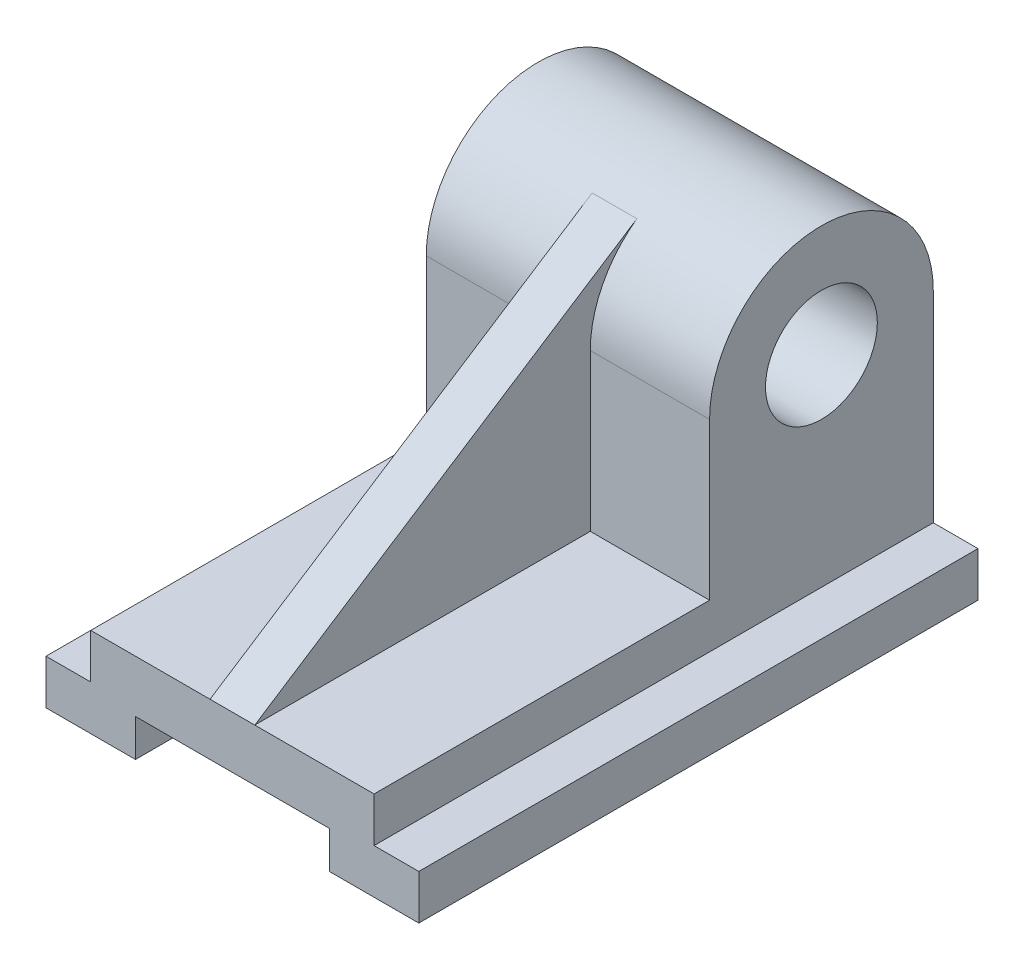
ISO-10303-21;
HEADER;
FILE_DESCRIPTION(('STEP AP214'),'2;1');
FILE_NAME('part.step','',(''),(''),'','','');
FILE_SCHEMA(('AUTOMOTIVE_DESIGN { 1 0 10303 214 1 1 1 1 }'));
ENDSEC;
DATA;
#1=APPLICATION_CONTEXT('core data for automotive mechanical design processes');
#2=APPLICATION_PROTOCOL_DEFINITION('international standard','automotive_design',2000,#1);
#3=PRODUCT_CONTEXT('',#1,'mechanical');
#4=PRODUCT('Part','Part','',(#3));
#5=PRODUCT_RELATED_PRODUCT_CATEGORY('part','',(#4));
#6=PRODUCT_DEFINITION_FORMATION('','',#4);
#7=PRODUCT_DEFINITION_CONTEXT('part definition',#1,'design');
#8=PRODUCT_DEFINITION('design','',#6,#7);
#9=PRODUCT_DEFINITION_SHAPE('','',#8);
#10=(LENGTH_UNIT() NAMED_UNIT(*) SI_UNIT(.MILLI.,.METRE.));
#11=(NAMED_UNIT(*) PLANE_ANGLE_UNIT() SI_UNIT($,.RADIAN.));
#12=(NAMED_UNIT(*) SI_UNIT($,.STERADIAN.) SOLID_ANGLE_UNIT());
#13=UNCERTAINTY_MEASURE_WITH_UNIT(LENGTH_MEASURE(1.E-05),#10,'distance_accuracy_value','');
#14=(GEOMETRIC_REPRESENTATION_CONTEXT(3) GLOBAL_UNCERTAINTY_ASSIGNED_CONTEXT((#13)) GLOBAL_UNIT_ASSIGNED_CONTEXT((#10,
#11,#12)) REPRESENTATION_CONTEXT('',''));
#15=CARTESIAN_POINT('',(0.,0.,0.));
#16=DIRECTION('',(0.,0.,1.));
#17=DIRECTION('',(1.,0.,0.));
#18=AXIS2_PLACEMENT_3D('',#15,#16,#17);
#19=CARTESIAN_POINT('',(-38.,12.,150.));
#20=DIRECTION('',(0.,-1.,0.));
#21=DIRECTION('',(0.,0.,-1.));
#22=AXIS2_PLACEMENT_3D('',#19,#20,#21);
#23=PLANE('',#22);
#24=DIRECTION('',(0.,0.,1.));
#25=VECTOR('',#24,1.);
#26=CARTESIAN_POINT('',(-6.,12.,150.));
#27=LINE('',#26,#25);
#28=CARTESIAN_POINT('',(-6.,12.,60.));
#29=VERTEX_POINT('',#28);
#30=CARTESIAN_POINT('',(-6.,12.,150.));
#31=VERTEX_POINT('',#30);
#32=EDGE_CURVE('E163',#29,#31,#27,.T.);
#33=ORIENTED_EDGE('',*,*,#32,.F.);
#34=DIRECTION('',(1.,0.,0.));
#35=VECTOR('',#34,1.);
#36=CARTESIAN_POINT('',(-38.,12.,60.));
#37=LINE('',#36,#35);
#38=CARTESIAN_POINT('',(-38.,12.,60.));
#39=VERTEX_POINT('',#38);
#40=EDGE_CURVE('E62',#39,#29,#37,.T.);
#41=ORIENTED_EDGE('',*,*,#40,.F.);
#42=DIRECTION('',(0.,0.,-1.));
#43=VECTOR('',#42,1.);
#44=CARTESIAN_POINT('',(-38.,12.,150.));
#45=LINE('',#44,#43);
#46=CARTESIAN_POINT('',(-38.,12.,150.));
#47=VERTEX_POINT('',#46);
#48=EDGE_CURVE('E183',#47,#39,#45,.T.);
#49=ORIENTED_EDGE('',*,*,#48,.F.);
#50=DIRECTION('',(-1.,0.,0.));
#51=VECTOR('',#50,1.);
#52=CARTESIAN_POINT('',(-38.,12.,150.));
#53=LINE('',#52,#51);
#54=EDGE_CURVE('E182',#31,#47,#53,.T.);
#55=ORIENTED_EDGE('',*,*,#54,.F.);
#56=EDGE_LOOP('',(#33,#41,#49,#55));
#57=FACE_BOUND('',#56,.T.);
#58=ADVANCED_FACE('F39',(#57),#23,.F.);
#59=CARTESIAN_POINT('',(-38.,54.,60.));
#60=DIRECTION('',(0.,0.,1.));
#61=DIRECTION('',(1.,0.,0.));
#62=AXIS2_PLACEMENT_3D('',#59,#60,#61);
#63=PLANE('',#62);
#64=ORIENTED_EDGE('',*,*,#40,.T.);
#65=DIRECTION('',(0.,1.,0.));
#66=VECTOR('',#65,1.);
#67=CARTESIAN_POINT('',(-6.,54.,60.));
#68=LINE('',#67,#66);
#69=CARTESIAN_POINT('',(-6.,54.,60.));
#70=VERTEX_POINT('',#69);
#71=EDGE_CURVE('E166',#29,#70,#68,.T.);
#72=ORIENTED_EDGE('',*,*,#71,.T.);
#73=DIRECTION('',(1.,0.,0.));
#74=VECTOR('',#73,1.);
#75=CARTESIAN_POINT('',(-38.,54.,60.));
#76=LINE('',#75,#74);
#77=CARTESIAN_POINT('',(-38.,54.,60.));
#78=VERTEX_POINT('',#77);
#79=EDGE_CURVE('E231',#78,#70,#76,.T.);
#80=ORIENTED_EDGE('',*,*,#79,.F.);
#81=DIRECTION('',(0.,-1.,0.));
#82=VECTOR('',#81,1.);
#83=CARTESIAN_POINT('',(-38.,54.,60.));
#84=LINE('',#83,#82);
#85=EDGE_CURVE('E215',#78,#39,#84,.T.);
#86=ORIENTED_EDGE('',*,*,#85,.T.);
#87=EDGE_LOOP('',(#64,#72,#80,#86));
#88=FACE_BOUND('',#87,.T.);
#89=ADVANCED_FACE('F428',(#88),#63,.T.);
#90=CARTESIAN_POINT('',(6.,12.,60.));
#91=VERTEX_POINT('',#90);
#92=CARTESIAN_POINT('',(38.,12.,60.));
#93=VERTEX_POINT('',#92);
#94=EDGE_CURVE('E230',#91,#93,#37,.T.);
#95=ORIENTED_EDGE('',*,*,#94,.F.);
#96=DIRECTION('',(0.,0.,1.));
#97=VECTOR('',#96,1.);
#98=CARTESIAN_POINT('',(6.,12.,150.));
#99=LINE('',#98,#97);
#100=CARTESIAN_POINT('',(6.,12.,150.));
#101=VERTEX_POINT('',#100);
#102=EDGE_CURVE('E195',#91,#101,#99,.T.);
#103=ORIENTED_EDGE('',*,*,#102,.T.);
#104=CARTESIAN_POINT('',(38.,12.,150.));
#105=VERTEX_POINT('',#104);
#106=EDGE_CURVE('E187',#105,#101,#53,.T.);
#107=ORIENTED_EDGE('',*,*,#106,.F.);
#108=DIRECTION('',(0.,0.,-1.));
#109=VECTOR('',#108,1.);
#110=CARTESIAN_POINT('',(38.,12.,150.));
#111=LINE('',#110,#109);
#112=EDGE_CURVE('E316',#105,#93,#111,.T.);
#113=ORIENTED_EDGE('',*,*,#112,.T.);
#114=EDGE_LOOP('',(#95,#103,#107,#113));
#115=FACE_BOUND('',#114,.T.);
#116=ADVANCED_FACE('F400',(#115),#23,.F.);
#117=CARTESIAN_POINT('',(-50.,-12.,150.));
#118=DIRECTION('',(1.,0.,0.));
#119=DIRECTION('',(0.,0.,-1.));
#120=AXIS2_PLACEMENT_3D('',#117,#118,#119);
#121=PLANE('',#120);
#122=DIRECTION('',(0.,-1.,0.));
#123=VECTOR('',#122,1.);
#124=CARTESIAN_POINT('',(-50.,-12.,0.));
#125=LINE('',#124,#123);
#126=CARTESIAN_POINT('',(-50.,0.,0.));
#127=VERTEX_POINT('',#126);
#128=CARTESIAN_POINT('',(-50.,-12.,0.));
#129=VERTEX_POINT('',#128);
#130=EDGE_CURVE('E229',#127,#129,#125,.T.);
#131=ORIENTED_EDGE('',*,*,#130,.T.);
#132=DIRECTION('',(0.,0.,-1.));
#133=VECTOR('',#132,1.);
#134=CARTESIAN_POINT('',(-50.,-12.,150.));
#135=LINE('',#134,#133);
#136=CARTESIAN_POINT('',(-50.,-12.,150.));
#137=VERTEX_POINT('',#136);
#138=EDGE_CURVE('E48',#137,#129,#135,.T.);
#139=ORIENTED_EDGE('',*,*,#138,.F.);
#140=DIRECTION('',(0.,-1.,0.));
#141=VECTOR('',#140,1.);
#142=CARTESIAN_POINT('',(-50.,-12.,150.));
#143=LINE('',#142,#141);
#144=CARTESIAN_POINT('',(-50.,0.,150.));
#145=VERTEX_POINT('',#144);
#146=EDGE_CURVE('E238',#145,#137,#143,.T.);
#147=ORIENTED_EDGE('',*,*,#146,.F.);
#148=DIRECTION('',(0.,0.,-1.));
#149=VECTOR('',#148,1.);
#150=CARTESIAN_POINT('',(-50.,0.,150.));
#151=LINE('',#150,#149);
#152=EDGE_CURVE('E273',#145,#127,#151,.T.);
#153=ORIENTED_EDGE('',*,*,#152,.T.);
#154=EDGE_LOOP('',(#131,#139,#147,#153));
#155=FACE_BOUND('',#154,.T.);
#156=ADVANCED_FACE('F41',(#155),#121,.F.);
#157=CARTESIAN_POINT('',(-50.,-12.,150.));
#158=DIRECTION('',(0.,1.,0.));
#159=DIRECTION('',(0.,0.,1.));
#160=AXIS2_PLACEMENT_3D('',#157,#158,#159);
#161=PLANE('',#160);
#162=DIRECTION('',(1.,0.,0.));
#163=VECTOR('',#162,1.);
#164=CARTESIAN_POINT('',(-50.,-12.,0.));
#165=LINE('',#164,#163);
#166=CARTESIAN_POINT('',(-26.,-12.,0.));
#167=VERTEX_POINT('',#166);
#168=EDGE_CURVE('E277',#129,#167,#165,.T.);
#169=ORIENTED_EDGE('',*,*,#168,.T.);
#170=DIRECTION('',(0.,0.,-1.));
#171=VECTOR('',#170,1.);
#172=CARTESIAN_POINT('',(-26.,-12.,150.));
#173=LINE('',#172,#171);
#174=CARTESIAN_POINT('',(-26.,-12.,150.));
#175=VERTEX_POINT('',#174);
#176=EDGE_CURVE('E344',#175,#167,#173,.T.);
#177=ORIENTED_EDGE('',*,*,#176,.F.);
#178=DIRECTION('',(1.,0.,0.));
#179=VECTOR('',#178,1.);
#180=CARTESIAN_POINT('',(-50.,-12.,150.));
#181=LINE('',#180,#179);
#182=EDGE_CURVE('E242',#137,#175,#181,.T.);
#183=ORIENTED_EDGE('',*,*,#182,.F.);
#184=ORIENTED_EDGE('',*,*,#138,.T.);
#185=EDGE_LOOP('',(#169,#177,#183,#184));
#186=FACE_BOUND('',#185,.T.);
#187=ADVANCED_FACE('F351',(#186),#161,.F.);
#188=CARTESIAN_POINT('',(-26.,-12.,150.));
#189=DIRECTION('',(-1.,0.,0.));
#190=DIRECTION('',(0.,-1.,0.));
#191=AXIS2_PLACEMENT_3D('',#188,#189,#190);
#192=PLANE('',#191);
#193=DIRECTION('',(0.,1.,0.));
#194=VECTOR('',#193,1.);
#195=CARTESIAN_POINT('',(-26.,-12.,0.));
#196=LINE('',#195,#194);
#197=CARTESIAN_POINT('',(-26.,-2.,0.));
#198=VERTEX_POINT('',#197);
#199=EDGE_CURVE('E280',#167,#198,#196,.T.);
#200=ORIENTED_EDGE('',*,*,#199,.T.);
#201=DIRECTION('',(0.,0.,-1.));
#202=VECTOR('',#201,1.);
#203=CARTESIAN_POINT('',(-26.,-2.,150.));
#204=LINE('',#203,#202);
#205=CARTESIAN_POINT('',(-26.,-2.,150.));
#206=VERTEX_POINT('',#205);
#207=EDGE_CURVE('E340',#206,#198,#204,.T.);
#208=ORIENTED_EDGE('',*,*,#207,.F.);
#209=DIRECTION('',(0.,1.,0.));
#210=VECTOR('',#209,1.);
#211=CARTESIAN_POINT('',(-26.,-12.,150.));
#212=LINE('',#211,#210);
#213=EDGE_CURVE('E246',#175,#206,#212,.T.);
#214=ORIENTED_EDGE('',*,*,#213,.F.);
#215=ORIENTED_EDGE('',*,*,#176,.T.);
#216=EDGE_LOOP('',(#200,#208,#214,#215));
#217=FACE_BOUND('',#216,.T.);
#218=ADVANCED_FACE('F365',(#217),#192,.F.);
#219=CARTESIAN_POINT('',(-26.,-2.,150.));
#220=DIRECTION('',(0.,1.,0.));
#221=DIRECTION('',(0.,0.,1.));
#222=AXIS2_PLACEMENT_3D('',#219,#220,#221);
#223=PLANE('',#222);
#224=DIRECTION('',(0.,0.,-1.));
#225=VECTOR('',#224,1.);
#226=CARTESIAN_POINT('',(26.,-2.,150.));
#227=LINE('',#226,#225);
#228=CARTESIAN_POINT('',(26.,-2.,150.));
#229=VERTEX_POINT('',#228);
#230=CARTESIAN_POINT('',(26.,-2.,0.));
#231=VERTEX_POINT('',#230);
#232=EDGE_CURVE('E336',#229,#231,#227,.T.);
#233=ORIENTED_EDGE('',*,*,#232,.F.);
#234=DIRECTION('',(1.,0.,0.));
#235=VECTOR('',#234,1.);
#236=CARTESIAN_POINT('',(-26.,-2.,150.));
#237=LINE('',#236,#235);
#238=EDGE_CURVE('E249',#206,#229,#237,.T.);
#239=ORIENTED_EDGE('',*,*,#238,.F.);
#240=ORIENTED_EDGE('',*,*,#207,.T.);
#241=DIRECTION('',(1.,0.,0.));
#242=VECTOR('',#241,1.);
#243=CARTESIAN_POINT('',(-26.,-2.,0.));
#244=LINE('',#243,#242);
#245=EDGE_CURVE('E283',#198,#231,#244,.T.);
#246=ORIENTED_EDGE('',*,*,#245,.T.);
#247=EDGE_LOOP('',(#233,#239,#240,#246));
#248=FACE_BOUND('',#247,.T.);
#249=ADVANCED_FACE('F370',(#248),#223,.F.);
#250=CARTESIAN_POINT('',(26.,-2.,150.));
#251=DIRECTION('',(1.,0.,0.));
#252=DIRECTION('',(0.,0.,-1.));
#253=AXIS2_PLACEMENT_3D('',#250,#251,#252);
#254=PLANE('',#253);
#255=DIRECTION('',(0.,-1.,0.));
#256=VECTOR('',#255,1.);
#257=CARTESIAN_POINT('',(26.,-2.,0.));
#258=LINE('',#257,#256);
#259=CARTESIAN_POINT('',(26.,-12.,0.));
#260=VERTEX_POINT('',#259);
#261=EDGE_CURVE('E286',#231,#260,#258,.T.);
#262=ORIENTED_EDGE('',*,*,#261,.T.);
#263=DIRECTION('',(0.,0.,-1.));
#264=VECTOR('',#263,1.);
#265=CARTESIAN_POINT('',(26.,-12.,150.));
#266=LINE('',#265,#264);
#267=CARTESIAN_POINT('',(26.,-12.,150.));
#268=VERTEX_POINT('',#267);
#269=EDGE_CURVE('E332',#268,#260,#266,.T.);
#270=ORIENTED_EDGE('',*,*,#269,.F.);
#271=DIRECTION('',(0.,-1.,0.));
#272=VECTOR('',#271,1.);
#273=CARTESIAN_POINT('',(26.,-2.,150.));
#274=LINE('',#273,#272);
#275=EDGE_CURVE('E252',#229,#268,#274,.T.);
#276=ORIENTED_EDGE('',*,*,#275,.F.);
#277=ORIENTED_EDGE('',*,*,#232,.T.);
#278=EDGE_LOOP('',(#262,#270,#276,#277));
#279=FACE_BOUND('',#278,.T.);
#280=ADVANCED_FACE('F418',(#279),#254,.F.);
#281=CARTESIAN_POINT('',(26.,-12.,150.));
#282=DIRECTION('',(0.,1.,0.));
#283=DIRECTION('',(0.,0.,1.));
#284=AXIS2_PLACEMENT_3D('',#281,#282,#283);
#285=PLANE('',#284);
#286=DIRECTION('',(1.,0.,0.));
#287=VECTOR('',#286,1.);
#288=CARTESIAN_POINT('',(26.,-12.,0.));
#289=LINE('',#288,#287);
#290=CARTESIAN_POINT('',(50.,-12.,0.));
#291=VERTEX_POINT('',#290);
#292=EDGE_CURVE('E289',#260,#291,#289,.T.);
#293=ORIENTED_EDGE('',*,*,#292,.T.);
#294=DIRECTION('',(0.,0.,-1.));
#295=VECTOR('',#294,1.);
#296=CARTESIAN_POINT('',(50.,-12.,150.));
#297=LINE('',#296,#295);
#298=CARTESIAN_POINT('',(50.,-12.,150.));
#299=VERTEX_POINT('',#298);
#300=EDGE_CURVE('E328',#299,#291,#297,.T.);
#301=ORIENTED_EDGE('',*,*,#300,.F.);
#302=DIRECTION('',(1.,0.,0.));
#303=VECTOR('',#302,1.);
#304=CARTESIAN_POINT('',(26.,-12.,150.));
#305=LINE('',#304,#303);
#306=EDGE_CURVE('E255',#268,#299,#305,.T.);
#307=ORIENTED_EDGE('',*,*,#306,.F.);
#308=ORIENTED_EDGE('',*,*,#269,.T.);
#309=EDGE_LOOP('',(#293,#301,#307,#308));
#310=FACE_BOUND('',#309,.T.);
#311=ADVANCED_FACE('F416',(#310),#285,.F.);
#312=CARTESIAN_POINT('',(50.,-12.,150.));
#313=DIRECTION('',(-1.,0.,0.));
#314=DIRECTION('',(0.,0.,1.));
#315=AXIS2_PLACEMENT_3D('',#312,#313,#314);
#316=PLANE('',#315);
#317=DIRECTION('',(0.,1.,0.));
#318=VECTOR('',#317,1.);
#319=CARTESIAN_POINT('',(50.,-12.,0.));
#320=LINE('',#319,#318);
#321=CARTESIAN_POINT('',(50.,0.,0.));
#322=VERTEX_POINT('',#321);
#323=EDGE_CURVE('E292',#291,#322,#320,.T.);
#324=ORIENTED_EDGE('',*,*,#323,.T.);
#325=DIRECTION('',(0.,0.,-1.));
#326=VECTOR('',#325,1.);
#327=CARTESIAN_POINT('',(50.,0.,150.));
#328=LINE('',#327,#326);
#329=CARTESIAN_POINT('',(50.,0.,150.));
#330=VERTEX_POINT('',#329);
#331=EDGE_CURVE('E324',#330,#322,#328,.T.);
#332=ORIENTED_EDGE('',*,*,#331,.F.);
#333=DIRECTION('',(0.,1.,0.));
#334=VECTOR('',#333,1.);
#335=CARTESIAN_POINT('',(50.,-12.,150.));
#336=LINE('',#335,#334);
#337=EDGE_CURVE('E258',#299,#330,#336,.T.);
#338=ORIENTED_EDGE('',*,*,#337,.F.);
#339=ORIENTED_EDGE('',*,*,#300,.T.);
#340=EDGE_LOOP('',(#324,#332,#338,#339));
#341=FACE_BOUND('',#340,.T.);
#342=ADVANCED_FACE('F412',(#341),#316,.F.);
#343=CARTESIAN_POINT('',(38.,0.,150.));
#344=DIRECTION('',(0.,-1.,0.));
#345=DIRECTION('',(0.,0.,-1.));
#346=AXIS2_PLACEMENT_3D('',#343,#344,#345);
#347=PLANE('',#346);
#348=DIRECTION('',(-1.,0.,0.));
#349=VECTOR('',#348,1.);
#350=CARTESIAN_POINT('',(38.,0.,0.));
#351=LINE('',#350,#349);
#352=CARTESIAN_POINT('',(38.,0.,0.));
#353=VERTEX_POINT('',#352);
#354=EDGE_CURVE('E295',#322,#353,#351,.T.);
#355=ORIENTED_EDGE('',*,*,#354,.T.);
#356=DIRECTION('',(0.,0.,-1.));
#357=VECTOR('',#356,1.);
#358=CARTESIAN_POINT('',(38.,0.,150.));
#359=LINE('',#358,#357);
#360=CARTESIAN_POINT('',(38.,0.,150.));
#361=VERTEX_POINT('',#360);
#362=EDGE_CURVE('E320',#361,#353,#359,.T.);
#363=ORIENTED_EDGE('',*,*,#362,.F.);
#364=DIRECTION('',(-1.,0.,0.));
#365=VECTOR('',#364,1.);
#366=CARTESIAN_POINT('',(38.,0.,150.));
#367=LINE('',#366,#365);
#368=EDGE_CURVE('E261',#330,#361,#367,.T.);
#369=ORIENTED_EDGE('',*,*,#368,.F.);
#370=ORIENTED_EDGE('',*,*,#331,.T.);
#371=EDGE_LOOP('',(#355,#363,#369,#370));
#372=FACE_BOUND('',#371,.T.);
#373=ADVANCED_FACE('F407',(#372),#347,.F.);
#374=CARTESIAN_POINT('',(38.,12.,150.));
#375=DIRECTION('',(-1.,0.,0.));
#376=DIRECTION('',(0.,0.,1.));
#377=AXIS2_PLACEMENT_3D('',#374,#375,#376);
#378=PLANE('',#377);
#379=DIRECTION('',(0.,1.,0.));
#380=VECTOR('',#379,1.);
#381=CARTESIAN_POINT('',(38.,12.,0.));
#382=LINE('',#381,#380);
#383=CARTESIAN_POINT('',(38.,54.,0.));
#384=VERTEX_POINT('',#383);
#385=EDGE_CURVE('E298',#353,#384,#382,.T.);
#386=ORIENTED_EDGE('',*,*,#385,.T.);
#387=CARTESIAN_POINT('',(38.,54.,30.));
#388=DIRECTION('',(1.,0.,0.));
#389=DIRECTION('',(0.,0.,-1.));
#390=AXIS2_PLACEMENT_3D('',#387,#388,#389);
#391=CIRCLE('',#390,30.);
#392=CARTESIAN_POINT('',(38.,54.,60.));
#393=VERTEX_POINT('',#392);
#394=EDGE_CURVE('E209',#384,#393,#391,.T.);
#395=ORIENTED_EDGE('',*,*,#394,.T.);
#396=DIRECTION('',(0.,-1.,0.));
#397=VECTOR('',#396,1.);
#398=CARTESIAN_POINT('',(38.,54.,60.));
#399=LINE('',#398,#397);
#400=EDGE_CURVE('E216',#393,#93,#399,.T.);
#401=ORIENTED_EDGE('',*,*,#400,.T.);
#402=ORIENTED_EDGE('',*,*,#112,.F.);
#403=DIRECTION('',(0.,1.,0.));
#404=VECTOR('',#403,1.);
#405=CARTESIAN_POINT('',(38.,12.,150.));
#406=LINE('',#405,#404);
#407=EDGE_CURVE('E188',#361,#105,#406,.T.);
#408=ORIENTED_EDGE('',*,*,#407,.F.);
#409=ORIENTED_EDGE('',*,*,#362,.T.);
#410=EDGE_LOOP('',(#386,#395,#401,#402,#408,#409));
#411=FACE_BOUND('',#410,.T.);
#412=CARTESIAN_POINT('',(38.,54.,30.));
#413=DIRECTION('',(1.,0.,0.));
#414=DIRECTION('',(0.,0.,-1.));
#415=AXIS2_PLACEMENT_3D('',#412,#413,#414);
#416=CIRCLE('',#415,15.);
#417=CARTESIAN_POINT('',(38.,54.,15.));
#418=VERTEX_POINT('',#417);
#419=EDGE_CURVE('E194',#418,#418,#416,.T.);
#420=ORIENTED_EDGE('',*,*,#419,.F.);
#421=EDGE_LOOP('',(#420));
#422=FACE_BOUND('',#421,.T.);
#423=ADVANCED_FACE('F391',(#411,#422),#378,.F.);
#424=CARTESIAN_POINT('',(-38.,0.,150.));
#425=DIRECTION('',(1.,0.,0.));
#426=DIRECTION('',(0.,0.,-1.));
#427=AXIS2_PLACEMENT_3D('',#424,#425,#426);
#428=PLANE('',#427);
#429=DIRECTION('',(0.,-1.,0.));
#430=VECTOR('',#429,1.);
#431=CARTESIAN_POINT('',(-38.,0.,0.));
#432=LINE('',#431,#430);
#433=CARTESIAN_POINT('',(-38.,54.,0.));
#434=VERTEX_POINT('',#433);
#435=CARTESIAN_POINT('',(-38.,0.,0.));
#436=VERTEX_POINT('',#435);
#437=EDGE_CURVE('E302',#434,#436,#432,.T.);
#438=ORIENTED_EDGE('',*,*,#437,.T.);
#439=DIRECTION('',(0.,0.,-1.));
#440=VECTOR('',#439,1.);
#441=CARTESIAN_POINT('',(-38.,0.,150.));
#442=LINE('',#441,#440);
#443=CARTESIAN_POINT('',(-38.,0.,150.));
#444=VERTEX_POINT('',#443);
#445=EDGE_CURVE('E310',#444,#436,#442,.T.);
#446=ORIENTED_EDGE('',*,*,#445,.F.);
#447=DIRECTION('',(0.,-1.,0.));
#448=VECTOR('',#447,1.);
#449=CARTESIAN_POINT('',(-38.,0.,150.));
#450=LINE('',#449,#448);
#451=EDGE_CURVE('E267',#47,#444,#450,.T.);
#452=ORIENTED_EDGE('',*,*,#451,.F.);
#453=ORIENTED_EDGE('',*,*,#48,.T.);
#454=ORIENTED_EDGE('',*,*,#85,.F.);
#455=CARTESIAN_POINT('',(-38.,54.,30.));
#456=DIRECTION('',(1.,0.,0.));
#457=DIRECTION('',(0.,0.,-1.));
#458=AXIS2_PLACEMENT_3D('',#455,#456,#457);
#459=CIRCLE('',#458,30.);
#460=EDGE_CURVE('E211',#434,#78,#459,.T.);
#461=ORIENTED_EDGE('',*,*,#460,.F.);
#462=EDGE_LOOP('',(#438,#446,#452,#453,#454,#461));
#463=FACE_BOUND('',#462,.T.);
#464=CARTESIAN_POINT('',(-38.,54.,30.));
#465=DIRECTION('',(1.,0.,0.));
#466=DIRECTION('',(0.,0.,-1.));
#467=AXIS2_PLACEMENT_3D('',#464,#465,#466);
#468=CIRCLE('',#467,15.);
#469=CARTESIAN_POINT('',(-38.,54.,15.));
#470=VERTEX_POINT('',#469);
#471=EDGE_CURVE('E200',#470,#470,#468,.T.);
#472=ORIENTED_EDGE('',*,*,#471,.T.);
#473=EDGE_LOOP('',(#472));
#474=FACE_BOUND('',#473,.T.);
#475=ADVANCED_FACE('F378',(#463,#474),#428,.F.);
#476=CARTESIAN_POINT('',(-50.,0.,150.));
#477=DIRECTION('',(0.,-1.,0.));
#478=DIRECTION('',(0.,0.,-1.));
#479=AXIS2_PLACEMENT_3D('',#476,#477,#478);
#480=PLANE('',#479);
#481=DIRECTION('',(-1.,0.,0.));
#482=VECTOR('',#481,1.);
#483=CARTESIAN_POINT('',(-50.,0.,0.));
#484=LINE('',#483,#482);
#485=EDGE_CURVE('E243',#436,#127,#484,.T.);
#486=ORIENTED_EDGE('',*,*,#485,.T.);
#487=ORIENTED_EDGE('',*,*,#152,.F.);
#488=DIRECTION('',(-1.,0.,0.));
#489=VECTOR('',#488,1.);
#490=CARTESIAN_POINT('',(-50.,0.,150.));
#491=LINE('',#490,#489);
#492=EDGE_CURVE('E270',#444,#145,#491,.T.);
#493=ORIENTED_EDGE('',*,*,#492,.F.);
#494=ORIENTED_EDGE('',*,*,#445,.T.);
#495=EDGE_LOOP('',(#486,#487,#493,#494));
#496=FACE_BOUND('',#495,.T.);
#497=ADVANCED_FACE('F376',(#496),#480,.F.);
#498=CARTESIAN_POINT('',(0.,0.,150.));
#499=DIRECTION('',(0.,0.,-1.));
#500=DIRECTION('',(-1.,0.,0.));
#501=AXIS2_PLACEMENT_3D('',#498,#499,#500);
#502=PLANE('',#501);
#503=ORIENTED_EDGE('',*,*,#106,.T.);
#504=DIRECTION('',(-1.,0.,0.));
#505=VECTOR('',#504,1.);
#506=CARTESIAN_POINT('',(0.,12.,150.));
#507=LINE('',#506,#505);
#508=EDGE_CURVE('E175',#31,#101,#507,.F.);
#509=ORIENTED_EDGE('',*,*,#508,.F.);
#510=ORIENTED_EDGE('',*,*,#54,.T.);
#511=ORIENTED_EDGE('',*,*,#451,.T.);
#512=ORIENTED_EDGE('',*,*,#492,.T.);
#513=ORIENTED_EDGE('',*,*,#146,.T.);
#514=ORIENTED_EDGE('',*,*,#182,.T.);
#515=ORIENTED_EDGE('',*,*,#213,.T.);
#516=ORIENTED_EDGE('',*,*,#238,.T.);
#517=ORIENTED_EDGE('',*,*,#275,.T.);
#518=ORIENTED_EDGE('',*,*,#306,.T.);
#519=ORIENTED_EDGE('',*,*,#337,.T.);
#520=ORIENTED_EDGE('',*,*,#368,.T.);
#521=ORIENTED_EDGE('',*,*,#407,.T.);
#522=EDGE_LOOP('',(#503,#509,#510,#511,#512,#513,#514,#515,#516,#517,#518,#519,#520,#521));
#523=FACE_BOUND('',#522,.T.);
#524=ADVANCED_FACE('F191',(#523),#502,.F.);
#525=CARTESIAN_POINT('',(0.,0.,0.));
#526=DIRECTION('',(0.,0.,-1.));
#527=DIRECTION('',(-1.,0.,0.));
#528=AXIS2_PLACEMENT_3D('',#525,#526,#527);
#529=PLANE('',#528);
#530=ORIENTED_EDGE('',*,*,#261,.F.);
#531=ORIENTED_EDGE('',*,*,#245,.F.);
#532=ORIENTED_EDGE('',*,*,#199,.F.);
#533=ORIENTED_EDGE('',*,*,#168,.F.);
#534=ORIENTED_EDGE('',*,*,#130,.F.);
#535=ORIENTED_EDGE('',*,*,#485,.F.);
#536=ORIENTED_EDGE('',*,*,#437,.F.);
#537=DIRECTION('',(1.,0.,0.));
#538=VECTOR('',#537,1.);
#539=CARTESIAN_POINT('',(-38.,54.,0.));
#540=LINE('',#539,#538);
#541=EDGE_CURVE('E220',#434,#384,#540,.T.);
#542=ORIENTED_EDGE('',*,*,#541,.T.);
#543=ORIENTED_EDGE('',*,*,#385,.F.);
#544=ORIENTED_EDGE('',*,*,#354,.F.);
#545=ORIENTED_EDGE('',*,*,#323,.F.);
#546=ORIENTED_EDGE('',*,*,#292,.F.);
#547=EDGE_LOOP('',(#530,#531,#532,#533,#534,#535,#536,#542,#543,#544,#545,#546));
#548=FACE_BOUND('',#547,.T.);
#549=ADVANCED_FACE('F360',(#548),#529,.T.);
#550=DIRECTION('',(0.,1.,0.));
#551=VECTOR('',#550,1.);
#552=CARTESIAN_POINT('',(6.,54.,60.));
#553=LINE('',#552,#551);
#554=CARTESIAN_POINT('',(6.,54.,60.));
#555=VERTEX_POINT('',#554);
#556=EDGE_CURVE('E203',#91,#555,#553,.T.);
#557=ORIENTED_EDGE('',*,*,#556,.F.);
#558=ORIENTED_EDGE('',*,*,#94,.T.);
#559=ORIENTED_EDGE('',*,*,#400,.F.);
#560=EDGE_CURVE('E235',#555,#393,#76,.T.);
#561=ORIENTED_EDGE('',*,*,#560,.F.);
#562=EDGE_LOOP('',(#557,#558,#559,#561));
#563=FACE_BOUND('',#562,.T.);
#564=ADVANCED_FACE('F396',(#563),#63,.T.);
#565=CARTESIAN_POINT('',(-38.,54.,30.));
#566=DIRECTION('',(1.,0.,0.));
#567=DIRECTION('',(0.,0.,-1.));
#568=AXIS2_PLACEMENT_3D('',#565,#566,#567);
#569=CYLINDRICAL_SURFACE('',#568,30.);
#570=ORIENTED_EDGE('',*,*,#394,.F.);
#571=ORIENTED_EDGE('',*,*,#541,.F.);
#572=ORIENTED_EDGE('',*,*,#460,.T.);
#573=ORIENTED_EDGE('',*,*,#79,.T.);
#574=CARTESIAN_POINT('',(-6.,54.,30.));
#575=DIRECTION('',(1.,0.,0.));
#576=DIRECTION('',(0.,0.,-1.));
#577=AXIS2_PLACEMENT_3D('',#574,#575,#576);
#578=CIRCLE('',#577,30.);
#579=CARTESIAN_POINT('',(-6.,78.3692492399858,47.4968480441322));
#580=VERTEX_POINT('',#579);
#581=EDGE_CURVE('E597',#70,#580,#578,.F.);
#582=ORIENTED_EDGE('',*,*,#581,.T.);
#583=DIRECTION('',(1.,0.,0.));
#584=VECTOR('',#583,1.);
#585=CARTESIAN_POINT('',(-38.,78.3692492399859,47.496848044132));
#586=LINE('',#585,#584);
#587=CARTESIAN_POINT('',(6.,78.3692492399858,47.4968480441322));
#588=VERTEX_POINT('',#587);
#589=EDGE_CURVE('E11',#588,#580,#586,.F.);
#590=ORIENTED_EDGE('',*,*,#589,.F.);
#591=CARTESIAN_POINT('',(6.,54.,30.));
#592=DIRECTION('',(1.,0.,0.));
#593=DIRECTION('',(0.,0.,-1.));
#594=AXIS2_PLACEMENT_3D('',#591,#592,#593);
#595=CIRCLE('',#594,30.);
#596=EDGE_CURVE('E169',#555,#588,#595,.F.);
#597=ORIENTED_EDGE('',*,*,#596,.F.);
#598=ORIENTED_EDGE('',*,*,#560,.T.);
#599=EDGE_LOOP('',(#570,#571,#572,#573,#582,#590,#597,#598));
#600=FACE_BOUND('',#599,.T.);
#601=ADVANCED_FACE('F386',(#600),#569,.T.);
#602=CARTESIAN_POINT('',(-38.,54.,30.));
#603=DIRECTION('',(1.,0.,0.));
#604=DIRECTION('',(0.,0.,-1.));
#605=AXIS2_PLACEMENT_3D('',#602,#603,#604);
#606=CYLINDRICAL_SURFACE('',#605,15.);
#607=ORIENTED_EDGE('',*,*,#419,.T.);
#608=EDGE_LOOP('',(#607));
#609=FACE_BOUND('',#608,.T.);
#610=ORIENTED_EDGE('',*,*,#471,.F.);
#611=EDGE_LOOP('',(#610));
#612=FACE_BOUND('',#611,.T.);
#613=ADVANCED_FACE('F494',(#609,#612),#606,.F.);
#614=CARTESIAN_POINT('',(6.,36.,75.));
#615=DIRECTION('',(1.,0.,0.));
#616=DIRECTION('',(0.,0.,-1.));
#617=AXIS2_PLACEMENT_3D('',#614,#615,#616);
#618=PLANE('',#617);
#619=ORIENTED_EDGE('',*,*,#102,.F.);
#620=ORIENTED_EDGE('',*,*,#556,.T.);
#621=ORIENTED_EDGE('',*,*,#596,.T.);
#622=DIRECTION('',(0.,0.543503389870826,-0.83940697233161));
#623=VECTOR('',#622,1.);
#624=CARTESIAN_POINT('',(6.,12.,150.));
#625=LINE('',#624,#623);
#626=EDGE_CURVE('E180',#101,#588,#625,.T.);
#627=ORIENTED_EDGE('',*,*,#626,.F.);
#628=EDGE_LOOP('',(#619,#620,#621,#627));
#629=FACE_BOUND('',#628,.T.);
#630=ADVANCED_FACE('F503',(#629),#618,.T.);
#631=CARTESIAN_POINT('',(-6.,36.,75.));
#632=DIRECTION('',(1.,0.,0.));
#633=DIRECTION('',(0.,0.,-1.));
#634=AXIS2_PLACEMENT_3D('',#631,#632,#633);
#635=PLANE('',#634);
#636=ORIENTED_EDGE('',*,*,#71,.F.);
#637=ORIENTED_EDGE('',*,*,#32,.T.);
#638=DIRECTION('',(0.,0.543503389870826,-0.83940697233161));
#639=VECTOR('',#638,1.);
#640=CARTESIAN_POINT('',(-6.,12.,150.));
#641=LINE('',#640,#639);
#642=EDGE_CURVE('E55',#31,#580,#641,.T.);
#643=ORIENTED_EDGE('',*,*,#642,.T.);
#644=ORIENTED_EDGE('',*,*,#581,.F.);
#645=EDGE_LOOP('',(#636,#637,#643,#644));
#646=FACE_BOUND('',#645,.T.);
#647=ADVANCED_FACE('F164',(#646),#635,.F.);
#648=CARTESIAN_POINT('',(0.,12.,150.));
#649=DIRECTION('',(0.,-0.839406972331611,-0.543503389870826));
#650=DIRECTION('',(0.,0.543503389870826,-0.83940697233161));
#651=AXIS2_PLACEMENT_3D('',#648,#649,#650);
#652=PLANE('',#651);
#653=ORIENTED_EDGE('',*,*,#642,.F.);
#654=ORIENTED_EDGE('',*,*,#508,.T.);
#655=ORIENTED_EDGE('',*,*,#626,.T.);
#656=ORIENTED_EDGE('',*,*,#589,.T.);
#657=EDGE_LOOP('',(#653,#654,#655,#656));
#658=FACE_BOUND('',#657,.T.);
#659=ADVANCED_FACE('F172',(#658),#652,.F.);
#660=CLOSED_SHELL('',(#58,#89,#116,#156,#187,#218,#249,#280,#311,#342,#373,#423,#475,#497,#524,
#549,#564,#601,#613,#630,#647,#659));
#661=MANIFOLD_SOLID_BREP('B2',#660);
#662=ADVANCED_BREP_SHAPE_REPRESENTATION('',(#18,#661),#14);
#663=SHAPE_DEFINITION_REPRESENTATION(#9,#662);
ENDSEC;
END-ISO-10303-21;
